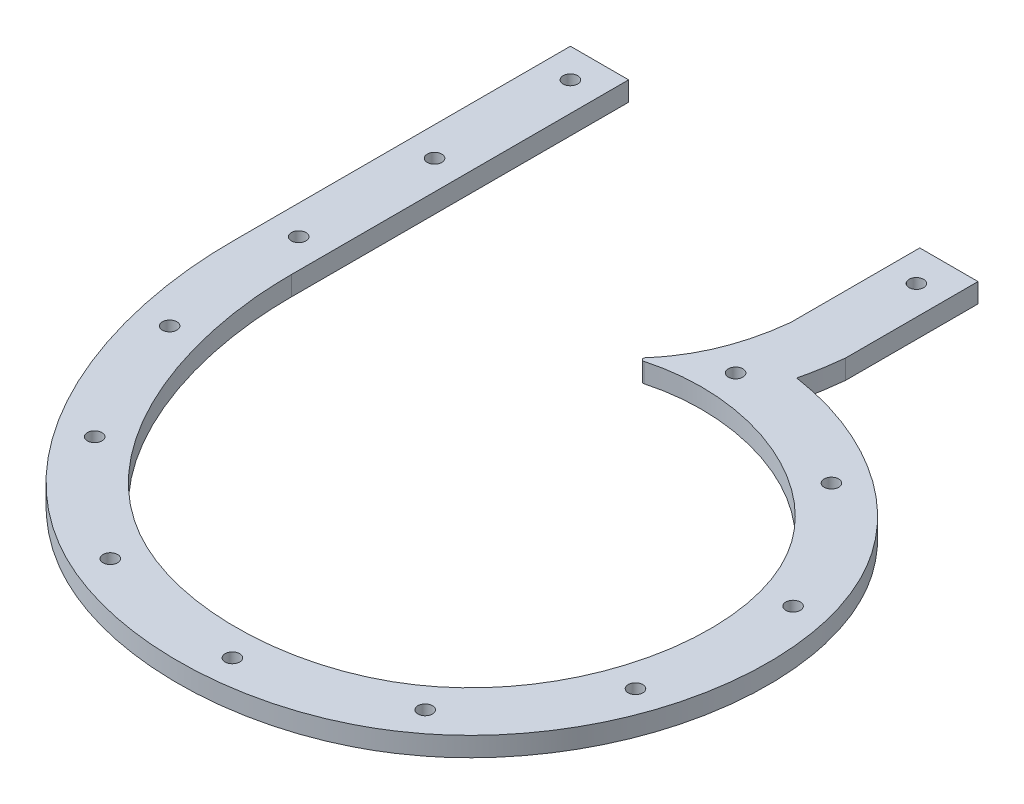
ISO-10303-21;
HEADER;
FILE_DESCRIPTION(('STEP AP214'),'2;1');
FILE_NAME('part.step','',(''),(''),'','','');
FILE_SCHEMA(('AUTOMOTIVE_DESIGN { 1 0 10303 214 1 1 1 1 }'));
ENDSEC;
DATA;
#1=APPLICATION_CONTEXT('core data for automotive mechanical design processes');
#2=APPLICATION_PROTOCOL_DEFINITION('international standard','automotive_design',2000,#1);
#3=PRODUCT_CONTEXT('',#1,'mechanical');
#4=PRODUCT('Part','Part','',(#3));
#5=PRODUCT_RELATED_PRODUCT_CATEGORY('part','',(#4));
#6=PRODUCT_DEFINITION_FORMATION('','',#4);
#7=PRODUCT_DEFINITION_CONTEXT('part definition',#1,'design');
#8=PRODUCT_DEFINITION('design','',#6,#7);
#9=PRODUCT_DEFINITION_SHAPE('','',#8);
#10=(LENGTH_UNIT() NAMED_UNIT(*) SI_UNIT(.MILLI.,.METRE.));
#11=(NAMED_UNIT(*) PLANE_ANGLE_UNIT() SI_UNIT($,.RADIAN.));
#12=(NAMED_UNIT(*) SI_UNIT($,.STERADIAN.) SOLID_ANGLE_UNIT());
#13=UNCERTAINTY_MEASURE_WITH_UNIT(LENGTH_MEASURE(1.E-05),#10,'distance_accuracy_value','');
#14=(GEOMETRIC_REPRESENTATION_CONTEXT(3) GLOBAL_UNCERTAINTY_ASSIGNED_CONTEXT((#13)) GLOBAL_UNIT_ASSIGNED_CONTEXT((#10,
#11,#12)) REPRESENTATION_CONTEXT('',''));
#15=CARTESIAN_POINT('',(0.,0.,0.));
#16=DIRECTION('',(0.,0.,1.));
#17=DIRECTION('',(1.,0.,0.));
#18=AXIS2_PLACEMENT_3D('',#15,#16,#17);
#19=CARTESIAN_POINT('',(19.05,6.35,-93.0525131214236));
#20=CARTESIAN_POINT('',(19.0235717626698,6.35,-92.8091366928728));
#21=CARTESIAN_POINT('',(18.9836928683942,6.35,-92.4430892244958));
#22=CARTESIAN_POINT('',(18.9314671624808,6.35,-91.9589572355302));
#23=CARTESIAN_POINT('',(18.8623607981838,6.35,-91.3379157509415));
#24=CARTESIAN_POINT('',(18.7762928711156,6.35,-90.6107808851603));
#25=CARTESIAN_POINT('',(18.6259027213404,6.35,-89.4251283904721));
#26=CARTESIAN_POINT('',(18.4201228683112,6.35,-87.9598584476399));
#27=CARTESIAN_POINT('',(18.0499905632596,6.35,-85.6275758075247));
#28=CARTESIAN_POINT('',(17.5101435713735,6.35,-82.7435971471794));
#29=CARTESIAN_POINT('',(16.996105498509,6.35,-80.4784646355363));
#30=CARTESIAN_POINT('',(16.7159863913014,6.35,-79.3485680085002));
#31=B_SPLINE_CURVE_WITH_KNOTS('',3,(#19,#20,#21,#22,#23,#24,#25,#26,#27,#28,#29,#30),
.UNSPECIFIED.,.F.,.F.,(4,1,1,1,1,1,1,1,1,4),(-0.0228949743215874,-0.00659054938911569,
0.00156166307712017,0.00971387554335602,0.0260183004758277,0.0423227254082994,
0.0749315752732429,0.107540425138186,0.172758124868073,0.23797582459796),.UNSPECIFIED.);
#32=DIRECTION('',(0.,-1.,0.));
#33=VECTOR('',#32,1.);
#34=SURFACE_OF_LINEAR_EXTRUSION('',#31,#33);
#35=CARTESIAN_POINT('',(19.05,0.,-93.0525131214236));
#36=CARTESIAN_POINT('',(19.0235717626698,0.,-92.8091366928728));
#37=CARTESIAN_POINT('',(18.9836928683942,0.,-92.4430892244958));
#38=CARTESIAN_POINT('',(18.9314671624808,0.,-91.9589572355302));
#39=CARTESIAN_POINT('',(18.8623607981838,0.,-91.3379157509415));
#40=CARTESIAN_POINT('',(18.7762928711156,0.,-90.6107808851603));
#41=CARTESIAN_POINT('',(18.6259027213404,0.,-89.4251283904721));
#42=CARTESIAN_POINT('',(18.4201228683112,0.,-87.9598584476399));
#43=CARTESIAN_POINT('',(18.0499905632596,0.,-85.6275758075247));
#44=CARTESIAN_POINT('',(17.5101435713735,0.,-82.7435971471794));
#45=CARTESIAN_POINT('',(16.996105498509,0.,-80.4784646355363));
#46=CARTESIAN_POINT('',(16.7159863913014,0.,-79.3485680085002));
#47=B_SPLINE_CURVE_WITH_KNOTS('',3,(#35,#36,#37,#38,#39,#40,#41,#42,#43,#44,#45,#46),
.UNSPECIFIED.,.F.,.F.,(4,1,1,1,1,1,1,1,1,4),(-0.0228949743215874,-0.00659054938911569,
0.00156166307712017,0.00971387554335602,0.0260183004758277,0.0423227254082994,
0.0749315752732429,0.107540425138186,0.172758124868073,0.23797582459796),.UNSPECIFIED.);
#48=CARTESIAN_POINT('',(19.05,0.,-93.0525131214236));
#49=VERTEX_POINT('',#48);
#50=CARTESIAN_POINT('',(16.7159863913014,0.,-79.3485680085002));
#51=VERTEX_POINT('',#50);
#52=EDGE_CURVE('E167',#49,#51,#47,.T.);
#53=ORIENTED_EDGE('',*,*,#52,.F.);
#54=DIRECTION('',(0.,-1.,0.));
#55=VECTOR('',#54,1.);
#56=CARTESIAN_POINT('',(19.05,6.35,-93.0525131214236));
#57=LINE('',#56,#55);
#58=CARTESIAN_POINT('',(19.05,6.35,-93.0525131214236));
#59=VERTEX_POINT('',#58);
#60=EDGE_CURVE('E162',#59,#49,#57,.T.);
#61=ORIENTED_EDGE('',*,*,#60,.F.);
#62=CARTESIAN_POINT('',(16.7159863913014,6.35,-79.3485680085002));
#63=VERTEX_POINT('',#62);
#64=EDGE_CURVE('E164',#59,#63,#31,.T.);
#65=ORIENTED_EDGE('',*,*,#64,.T.);
#66=DIRECTION('',(0.,-1.,0.));
#67=VECTOR('',#66,1.);
#68=CARTESIAN_POINT('',(16.7159863913014,6.35,-79.3485680085002));
#69=LINE('',#68,#67);
#70=EDGE_CURVE('E293',#63,#51,#69,.T.);
#71=ORIENTED_EDGE('',*,*,#70,.T.);
#72=EDGE_LOOP('',(#53,#61,#65,#71));
#73=FACE_BOUND('',#72,.T.);
#74=ADVANCED_FACE('F67',(#73),#34,.T.);
#75=CARTESIAN_POINT('',(19.05,6.35,0.));
#76=DIRECTION('',(1.,0.,0.));
#77=DIRECTION('',(0.,0.,-1.));
#78=AXIS2_PLACEMENT_3D('',#75,#76,#77);
#79=PLANE('',#78);
#80=DIRECTION('',(0.,0.,1.));
#81=VECTOR('',#80,1.);
#82=CARTESIAN_POINT('',(19.05,0.,0.));
#83=LINE('',#82,#81);
#84=CARTESIAN_POINT('',(19.05,0.,-136.334024978483));
#85=VERTEX_POINT('',#84);
#86=EDGE_CURVE('E660',#85,#49,#83,.T.);
#87=ORIENTED_EDGE('',*,*,#86,.F.);
#88=DIRECTION('',(0.,-1.,0.));
#89=VECTOR('',#88,1.);
#90=CARTESIAN_POINT('',(19.05,6.35,-136.334024978483));
#91=LINE('',#90,#89);
#92=CARTESIAN_POINT('',(19.05,6.35,-136.334024978483));
#93=VERTEX_POINT('',#92);
#94=EDGE_CURVE('E173',#93,#85,#91,.T.);
#95=ORIENTED_EDGE('',*,*,#94,.F.);
#96=DIRECTION('',(0.,0.,1.));
#97=VECTOR('',#96,1.);
#98=CARTESIAN_POINT('',(19.05,6.35,0.));
#99=LINE('',#98,#97);
#100=EDGE_CURVE('E178',#93,#59,#99,.T.);
#101=ORIENTED_EDGE('',*,*,#100,.T.);
#102=ORIENTED_EDGE('',*,*,#60,.T.);
#103=EDGE_LOOP('',(#87,#95,#101,#102));
#104=FACE_BOUND('',#103,.T.);
#105=ADVANCED_FACE('F183',(#104),#79,.T.);
#106=CARTESIAN_POINT('',(0.,6.35,-136.334024978483));
#107=DIRECTION('',(0.,0.,1.));
#108=DIRECTION('',(1.,0.,0.));
#109=AXIS2_PLACEMENT_3D('',#106,#107,#108);
#110=PLANE('',#109);
#111=DIRECTION('',(-1.,0.,0.));
#112=VECTOR('',#111,1.);
#113=CARTESIAN_POINT('',(0.,0.,-136.334024978483));
#114=LINE('',#113,#112);
#115=CARTESIAN_POINT('',(0.,0.,-136.334024978483));
#116=VERTEX_POINT('',#115);
#117=EDGE_CURVE('E662',#85,#116,#114,.T.);
#118=ORIENTED_EDGE('',*,*,#117,.T.);
#119=DIRECTION('',(0.,-1.,0.));
#120=VECTOR('',#119,1.);
#121=CARTESIAN_POINT('',(0.,6.35,-136.334024978483));
#122=LINE('',#121,#120);
#123=CARTESIAN_POINT('',(0.,6.35,-136.334024978483));
#124=VERTEX_POINT('',#123);
#125=EDGE_CURVE('E305',#124,#116,#122,.T.);
#126=ORIENTED_EDGE('',*,*,#125,.F.);
#127=DIRECTION('',(-1.,0.,0.));
#128=VECTOR('',#127,1.);
#129=CARTESIAN_POINT('',(0.,6.35,-136.334024978483));
#130=LINE('',#129,#128);
#131=EDGE_CURVE('E185',#93,#124,#130,.T.);
#132=ORIENTED_EDGE('',*,*,#131,.F.);
#133=ORIENTED_EDGE('',*,*,#94,.T.);
#134=EDGE_LOOP('',(#118,#126,#132,#133));
#135=FACE_BOUND('',#134,.T.);
#136=ADVANCED_FACE('F219',(#135),#110,.F.);
#137=CARTESIAN_POINT('',(0.,6.35,0.));
#138=DIRECTION('',(1.,0.,0.));
#139=DIRECTION('',(0.,0.,-1.));
#140=AXIS2_PLACEMENT_3D('',#137,#138,#139);
#141=PLANE('',#140);
#142=DIRECTION('',(0.,0.,1.));
#143=VECTOR('',#142,1.);
#144=CARTESIAN_POINT('',(0.,0.,0.));
#145=LINE('',#144,#143);
#146=CARTESIAN_POINT('',(0.,0.,-94.2223410161257));
#147=VERTEX_POINT('',#146);
#148=EDGE_CURVE('E274',#116,#147,#145,.T.);
#149=ORIENTED_EDGE('',*,*,#148,.T.);
#150=DIRECTION('',(0.,1.,0.));
#151=VECTOR('',#150,1.);
#152=CARTESIAN_POINT('',(0.,6.35,-94.2223410161257));
#153=LINE('',#152,#151);
#154=CARTESIAN_POINT('',(0.,6.35,-94.2223410161257));
#155=VERTEX_POINT('',#154);
#156=EDGE_CURVE('E311',#147,#155,#153,.T.);
#157=ORIENTED_EDGE('',*,*,#156,.T.);
#158=DIRECTION('',(0.,0.,1.));
#159=VECTOR('',#158,1.);
#160=CARTESIAN_POINT('',(0.,6.35,0.));
#161=LINE('',#160,#159);
#162=EDGE_CURVE('E187',#124,#155,#161,.T.);
#163=ORIENTED_EDGE('',*,*,#162,.F.);
#164=ORIENTED_EDGE('',*,*,#125,.T.);
#165=EDGE_LOOP('',(#149,#157,#163,#164));
#166=FACE_BOUND('',#165,.T.);
#167=ADVANCED_FACE('F215',(#166),#141,.F.);
#168=CARTESIAN_POINT('',(0.,6.35,-94.0838012465403));
#169=CARTESIAN_POINT('',(-2.43138633589178,6.35,-71.6932757089573));
#170=CARTESIAN_POINT('',(-15.7582559300183,6.35,-58.2304301464796));
#171=B_SPLINE_CURVE_WITH_KNOTS('',2,(#168,#169,#170),.UNSPECIFIED.,.F.,.F.,(3,3),(0.,1.),.UNSPECIFIED.);
#172=DIRECTION('',(0.,-1.,0.));
#173=VECTOR('',#172,1.);
#174=SURFACE_OF_LINEAR_EXTRUSION('',#171,#173);
#175=CARTESIAN_POINT('',(0.,0.,-94.0838012465403));
#176=CARTESIAN_POINT('',(-2.43138633589178,0.,-71.6932757089573));
#177=CARTESIAN_POINT('',(-15.7582559300183,0.,-58.2304301464796));
#178=B_SPLINE_CURVE_WITH_KNOTS('',2,(#175,#176,#177),.UNSPECIFIED.,.F.,.F.,(3,3),(0.,1.),.UNSPECIFIED.);
#179=CARTESIAN_POINT('',(-0.0152968925248014,0.,-93.9439991056898));
#180=VERTEX_POINT('',#179);
#181=CARTESIAN_POINT('',(-13.755858664629,0.,-60.373257901927));
#182=VERTEX_POINT('',#181);
#183=EDGE_CURVE('E270',#180,#182,#178,.T.);
#184=ORIENTED_EDGE('',*,*,#183,.T.);
#185=DIRECTION('',(0.,-1.,0.));
#186=VECTOR('',#185,1.);
#187=CARTESIAN_POINT('',(-13.755858664629,0.,-60.373257901927));
#188=LINE('',#187,#186);
#189=CARTESIAN_POINT('',(-13.755858664629,6.35,-60.373257901927));
#190=VERTEX_POINT('',#189);
#191=EDGE_CURVE('E75',#182,#190,#188,.F.);
#192=ORIENTED_EDGE('',*,*,#191,.T.);
#193=CARTESIAN_POINT('',(-0.0152968925248014,6.35,-93.9439991056898));
#194=VERTEX_POINT('',#193);
#195=EDGE_CURVE('E196',#194,#190,#171,.T.);
#196=ORIENTED_EDGE('',*,*,#195,.F.);
#197=DIRECTION('',(0.,-1.,0.));
#198=VECTOR('',#197,1.);
#199=CARTESIAN_POINT('',(-0.0152968925248033,6.35,-93.9439991056898));
#200=LINE('',#199,#198);
#201=EDGE_CURVE('E172',#194,#180,#200,.T.);
#202=ORIENTED_EDGE('',*,*,#201,.T.);
#203=EDGE_LOOP('',(#184,#192,#196,#202));
#204=FACE_BOUND('',#203,.T.);
#205=ADVANCED_FACE('F210',(#204),#174,.F.);
#206=CARTESIAN_POINT('',(-15.7582559300183,6.35,-58.2304301464796));
#207=CARTESIAN_POINT('',(12.9289974081269,6.35,-67.7641355953099));
#208=CARTESIAN_POINT('',(70.6012230100739,6.35,-46.2471030474948));
#209=CARTESIAN_POINT('',(77.5403837984392,6.35,26.2134938435259));
#210=CARTESIAN_POINT('',(40.5187887248898,6.35,85.7752611581171));
#211=CARTESIAN_POINT('',(-67.0551085723347,6.35,88.3042799218699));
#212=CARTESIAN_POINT('',(-95.4157076808293,6.35,10.2144859273095));
#213=CARTESIAN_POINT('',(-95.25,6.35,-26.0301706486655));
#214=B_SPLINE_CURVE_WITH_KNOTS('',3,(#206,#207,#208,#209,#210,#211,#212,#213),.UNSPECIFIED.,.F.,
.F.,(4,1,1,1,1,4),(0.,0.227546357084691,0.356849792544047,0.495812359937748,0.710996888369488,
1.),.UNSPECIFIED.);
#215=DIRECTION('',(0.,-1.,0.));
#216=VECTOR('',#215,1.);
#217=SURFACE_OF_LINEAR_EXTRUSION('',#214,#216);
#218=CARTESIAN_POINT('',(-12.9496367933821,6.35,-59.0830694012671));
#219=VERTEX_POINT('',#218);
#220=CARTESIAN_POINT('',(-95.2500259941821,6.35,-26.0244551898569));
#221=VERTEX_POINT('',#220);
#222=EDGE_CURVE('E201',#219,#221,#214,.T.);
#223=ORIENTED_EDGE('',*,*,#222,.F.);
#224=DIRECTION('',(0.,-1.,0.));
#225=VECTOR('',#224,1.);
#226=CARTESIAN_POINT('',(-12.9496367933821,6.35,-59.0830694012671));
#227=LINE('',#226,#225);
#228=CARTESIAN_POINT('',(-12.9496367933821,0.,-59.0830694012671));
#229=VERTEX_POINT('',#228);
#230=EDGE_CURVE('E259',#219,#229,#227,.T.);
#231=ORIENTED_EDGE('',*,*,#230,.T.);
#232=CARTESIAN_POINT('',(-15.7582559300183,0.,-58.2304301464796));
#233=CARTESIAN_POINT('',(12.9289974081269,0.,-67.7641355953099));
#234=CARTESIAN_POINT('',(70.6012230100739,0.,-46.2471030474948));
#235=CARTESIAN_POINT('',(77.5403837984392,0.,26.2134938435259));
#236=CARTESIAN_POINT('',(40.5187887248898,0.,85.7752611581171));
#237=CARTESIAN_POINT('',(-67.0551085723347,0.,88.3042799218699));
#238=CARTESIAN_POINT('',(-95.4157076808293,0.,10.2144859273095));
#239=CARTESIAN_POINT('',(-95.25,0.,-26.0301706486655));
#240=B_SPLINE_CURVE_WITH_KNOTS('',3,(#232,#233,#234,#235,#236,#237,#238,#239),.UNSPECIFIED.,.F.,
.F.,(4,1,1,1,1,4),(0.,0.227546357084691,0.356849792544047,0.495812359937748,0.710996888369488,
1.),.UNSPECIFIED.);
#241=CARTESIAN_POINT('',(-95.2500259941821,0.,-26.0244551898569));
#242=VERTEX_POINT('',#241);
#243=EDGE_CURVE('E265',#229,#242,#240,.T.);
#244=ORIENTED_EDGE('',*,*,#243,.T.);
#245=DIRECTION('',(0.,-1.,0.));
#246=VECTOR('',#245,1.);
#247=CARTESIAN_POINT('',(-95.2500259941821,0.,-26.0244551898569));
#248=LINE('',#247,#246);
#249=EDGE_CURVE('E245',#242,#221,#248,.F.);
#250=ORIENTED_EDGE('',*,*,#249,.T.);
#251=EDGE_LOOP('',(#223,#231,#244,#250));
#252=FACE_BOUND('',#251,.T.);
#253=ADVANCED_FACE('F214',(#252),#217,.F.);
#254=CARTESIAN_POINT('',(-95.25,6.35,0.));
#255=DIRECTION('',(1.,0.,0.));
#256=DIRECTION('',(0.,0.,-1.));
#257=AXIS2_PLACEMENT_3D('',#254,#255,#256);
#258=PLANE('',#257);
#259=DIRECTION('',(0.,0.,1.));
#260=VECTOR('',#259,1.);
#261=CARTESIAN_POINT('',(-95.25,6.35,0.));
#262=LINE('',#261,#260);
#263=CARTESIAN_POINT('',(-95.25,6.35,-136.334024978483));
#264=VERTEX_POINT('',#263);
#265=CARTESIAN_POINT('',(-95.25,6.35,-26.0359464808754));
#266=VERTEX_POINT('',#265);
#267=EDGE_CURVE('E316',#264,#266,#262,.T.);
#268=ORIENTED_EDGE('',*,*,#267,.T.);
#269=DIRECTION('',(0.,1.,0.));
#270=VECTOR('',#269,1.);
#271=CARTESIAN_POINT('',(-95.25,0.,-26.0359464808754));
#272=LINE('',#271,#270);
#273=CARTESIAN_POINT('',(-95.25,0.,-26.0359464808754));
#274=VERTEX_POINT('',#273);
#275=EDGE_CURVE('E247',#266,#274,#272,.F.);
#276=ORIENTED_EDGE('',*,*,#275,.T.);
#277=DIRECTION('',(0.,0.,1.));
#278=VECTOR('',#277,1.);
#279=CARTESIAN_POINT('',(-95.25,0.,0.));
#280=LINE('',#279,#278);
#281=CARTESIAN_POINT('',(-95.25,0.,-136.334024978483));
#282=VERTEX_POINT('',#281);
#283=EDGE_CURVE('E269',#282,#274,#280,.T.);
#284=ORIENTED_EDGE('',*,*,#283,.F.);
#285=DIRECTION('',(0.,-1.,0.));
#286=VECTOR('',#285,1.);
#287=CARTESIAN_POINT('',(-95.25,6.35,-136.334024978483));
#288=LINE('',#287,#286);
#289=EDGE_CURVE('E303',#264,#282,#288,.T.);
#290=ORIENTED_EDGE('',*,*,#289,.F.);
#291=EDGE_LOOP('',(#268,#276,#284,#290));
#292=FACE_BOUND('',#291,.T.);
#293=ADVANCED_FACE('F315',(#292),#258,.T.);
#294=CARTESIAN_POINT('',(0.,6.35,-136.334024978483));
#295=DIRECTION('',(0.,0.,1.));
#296=DIRECTION('',(1.,0.,0.));
#297=AXIS2_PLACEMENT_3D('',#294,#295,#296);
#298=PLANE('',#297);
#299=DIRECTION('',(-1.,0.,0.));
#300=VECTOR('',#299,1.);
#301=CARTESIAN_POINT('',(0.,0.,-136.334024978483));
#302=LINE('',#301,#300);
#303=CARTESIAN_POINT('',(-114.3,0.,-136.334024978483));
#304=VERTEX_POINT('',#303);
#305=EDGE_CURVE('E272',#282,#304,#302,.T.);
#306=ORIENTED_EDGE('',*,*,#305,.T.);
#307=DIRECTION('',(0.,-1.,0.));
#308=VECTOR('',#307,1.);
#309=CARTESIAN_POINT('',(-114.3,6.35,-136.334024978483));
#310=LINE('',#309,#308);
#311=CARTESIAN_POINT('',(-114.3,6.35,-136.334024978483));
#312=VERTEX_POINT('',#311);
#313=EDGE_CURVE('E300',#312,#304,#310,.T.);
#314=ORIENTED_EDGE('',*,*,#313,.F.);
#315=DIRECTION('',(-1.,0.,0.));
#316=VECTOR('',#315,1.);
#317=CARTESIAN_POINT('',(0.,6.35,-136.334024978483));
#318=LINE('',#317,#316);
#319=EDGE_CURVE('E328',#264,#312,#318,.T.);
#320=ORIENTED_EDGE('',*,*,#319,.F.);
#321=ORIENTED_EDGE('',*,*,#289,.T.);
#322=EDGE_LOOP('',(#306,#314,#320,#321));
#323=FACE_BOUND('',#322,.T.);
#324=ADVANCED_FACE('F321',(#323),#298,.F.);
#325=CARTESIAN_POINT('',(-114.3,6.35,0.));
#326=DIRECTION('',(1.,0.,0.));
#327=DIRECTION('',(0.,0.,-1.));
#328=AXIS2_PLACEMENT_3D('',#325,#326,#327);
#329=PLANE('',#328);
#330=DIRECTION('',(0.,0.,1.));
#331=VECTOR('',#330,1.);
#332=CARTESIAN_POINT('',(-114.3,0.,0.));
#333=LINE('',#332,#331);
#334=CARTESIAN_POINT('',(-114.3,0.,-26.0721112281661));
#335=VERTEX_POINT('',#334);
#336=EDGE_CURVE('E286',#304,#335,#333,.T.);
#337=ORIENTED_EDGE('',*,*,#336,.T.);
#338=DIRECTION('',(0.,-1.,0.));
#339=VECTOR('',#338,1.);
#340=CARTESIAN_POINT('',(-114.3,6.35,-26.0721112281661));
#341=LINE('',#340,#339);
#342=CARTESIAN_POINT('',(-114.3,6.35,-26.0721112281661));
#343=VERTEX_POINT('',#342);
#344=EDGE_CURVE('E298',#343,#335,#341,.T.);
#345=ORIENTED_EDGE('',*,*,#344,.F.);
#346=DIRECTION('',(0.,0.,1.));
#347=VECTOR('',#346,1.);
#348=CARTESIAN_POINT('',(-114.3,6.35,0.));
#349=LINE('',#348,#347);
#350=EDGE_CURVE('E327',#312,#343,#349,.T.);
#351=ORIENTED_EDGE('',*,*,#350,.F.);
#352=ORIENTED_EDGE('',*,*,#313,.T.);
#353=EDGE_LOOP('',(#337,#345,#351,#352));
#354=FACE_BOUND('',#353,.T.);
#355=ADVANCED_FACE('F325',(#354),#329,.F.);
#356=CARTESIAN_POINT('',(16.7159863913014,6.35,-79.3485680085002));
#357=CARTESIAN_POINT('',(21.6330978705224,6.35,-78.6271989598531));
#358=CARTESIAN_POINT('',(31.3718572612699,6.35,-76.3897218941116));
#359=CARTESIAN_POINT('',(45.2492004972199,6.35,-70.8452769607163));
#360=CARTESIAN_POINT('',(58.1427020202069,6.35,-63.2023547019803));
#361=CARTESIAN_POINT('',(69.6942684990019,6.35,-53.48659400402));
#362=CARTESIAN_POINT('',(77.8316458808527,6.35,-43.6787438983676));
#363=CARTESIAN_POINT('',(83.1663553001762,6.35,-34.7783260421134));
#364=CARTESIAN_POINT('',(87.5006566564551,6.35,-25.5003387116442));
#365=CARTESIAN_POINT('',(91.1570644324476,6.35,-13.4000448880706));
#366=CARTESIAN_POINT('',(92.9989240789807,6.35,1.46366621805663));
#367=CARTESIAN_POINT('',(92.5331586276137,6.35,16.3321608555447));
#368=CARTESIAN_POINT('',(89.9113480457351,6.35,30.9228680078494));
#369=CARTESIAN_POINT('',(85.2246697026399,6.35,44.926534482478));
#370=CARTESIAN_POINT('',(78.5424766002794,6.35,58.0873215625547));
#371=CARTESIAN_POINT('',(69.8929665542091,6.35,70.1280882226925));
#372=CARTESIAN_POINT('',(59.3342250850972,6.35,80.7225189459671));
#373=CARTESIAN_POINT('',(46.8082946762808,6.35,89.4843789599546));
#374=CARTESIAN_POINT('',(33.1657508535722,6.35,95.8312045365591));
#375=CARTESIAN_POINT('',(18.8220757998214,6.35,100.000437450495));
#376=CARTESIAN_POINT('',(4.08382286145167,6.35,102.10160242432));
#377=CARTESIAN_POINT('',(-10.7774412230892,6.35,102.21979996101));
#378=CARTESIAN_POINT('',(-25.5048511364746,6.35,100.381408636179));
#379=CARTESIAN_POINT('',(-37.4527415030442,6.35,97.1973224935949));
#380=CARTESIAN_POINT('',(-46.6656390896169,6.35,93.6226539944936));
#381=CARTESIAN_POINT('',(-53.3782339827533,6.35,90.4042691275464));
#382=CARTESIAN_POINT('',(-59.7780191628772,6.35,86.6678318366041));
#383=CARTESIAN_POINT('',(-67.7729642470086,6.35,81.1134949695859));
#384=CARTESIAN_POINT('',(-76.7948383172267,6.35,73.1919966973664));
#385=CARTESIAN_POINT('',(-86.0825071986507,6.35,62.4802459776523));
#386=CARTESIAN_POINT('',(-96.5268651878926,6.35,46.9789350867326));
#387=CARTESIAN_POINT('',(-104.247410810002,6.35,30.1516401250863));
#388=CARTESIAN_POINT('',(-109.533831829891,6.35,12.8006946264713));
#389=CARTESIAN_POINT('',(-112.324631517154,6.35,-0.30605110665803));
#390=CARTESIAN_POINT('',(-113.69827349308,6.35,-11.1587802232802));
#391=CARTESIAN_POINT('',(-114.231429958165,6.35,-19.7408930873515));
#392=CARTESIAN_POINT('',(-114.308990647516,6.35,-23.9549561001606));
#393=CARTESIAN_POINT('',(-114.3,6.35,-26.0721112281661));
#394=B_SPLINE_CURVE_WITH_KNOTS('',3,(#356,#357,#358,#359,#360,#361,#362,#363,#364,#365,#366,
#367,#368,#369,#370,#371,#372,#373,#374,#375,#376,#377,#378,#379,#380,#381,#382,#383,#384,#385,
#386,#387,#388,#389,#390,#391,#392,#393),.UNSPECIFIED.,.F.,.F.,(4,1,1,1,1,1,1,1,1,1,1,1,1,1,1,1,
1,1,1,1,1,1,1,1,1,1,1,1,1,1,1,1,1,1,1,4),(0.0744180317666386,0.103339232907731,
0.132260434048823,0.161181635189916,0.190102836331008,0.2190240374721,0.233484638042646,
0.247945238613193,0.276866439754285,0.305787640895377,0.33470884203647,0.363630043177562,
0.392551244318654,0.421472445459747,0.450393646600839,0.479314847741931,0.508236048883024,
0.537157250024116,0.566078451165208,0.594999652306301,0.623920853447393,0.652842054588485,
0.681763255729578,0.696223856300124,0.71068445687067,0.725145057441216,0.739605658011762,
0.768526859152855,0.797448060293947,0.826369261435039,0.884211663717224,0.913132864858316,
0.942054065999409,0.970975267140501,0.985435867711047,0.999896468281593),.UNSPECIFIED.);
#395=DIRECTION('',(0.,-1.,0.));
#396=VECTOR('',#395,1.);
#397=SURFACE_OF_LINEAR_EXTRUSION('',#394,#396);
#398=CARTESIAN_POINT('',(16.7159863913014,0.,-79.3485680085002));
#399=CARTESIAN_POINT('',(21.6330978705224,0.,-78.6271989598531));
#400=CARTESIAN_POINT('',(31.3718572612699,0.,-76.3897218941116));
#401=CARTESIAN_POINT('',(45.2492004972199,0.,-70.8452769607163));
#402=CARTESIAN_POINT('',(58.1427020202069,0.,-63.2023547019803));
#403=CARTESIAN_POINT('',(69.6942684990019,0.,-53.48659400402));
#404=CARTESIAN_POINT('',(77.8316458808527,0.,-43.6787438983676));
#405=CARTESIAN_POINT('',(83.1663553001762,0.,-34.7783260421134));
#406=CARTESIAN_POINT('',(87.5006566564551,0.,-25.5003387116442));
#407=CARTESIAN_POINT('',(91.1570644324476,0.,-13.4000448880706));
#408=CARTESIAN_POINT('',(92.9989240789807,0.,1.46366621805663));
#409=CARTESIAN_POINT('',(92.5331586276137,0.,16.3321608555447));
#410=CARTESIAN_POINT('',(89.9113480457351,0.,30.9228680078494));
#411=CARTESIAN_POINT('',(85.2246697026399,0.,44.926534482478));
#412=CARTESIAN_POINT('',(78.5424766002794,0.,58.0873215625547));
#413=CARTESIAN_POINT('',(69.8929665542091,0.,70.1280882226925));
#414=CARTESIAN_POINT('',(59.3342250850972,0.,80.7225189459671));
#415=CARTESIAN_POINT('',(46.8082946762808,0.,89.4843789599546));
#416=CARTESIAN_POINT('',(33.1657508535722,0.,95.8312045365591));
#417=CARTESIAN_POINT('',(18.8220757998214,0.,100.000437450495));
#418=CARTESIAN_POINT('',(4.08382286145167,0.,102.10160242432));
#419=CARTESIAN_POINT('',(-10.7774412230892,0.,102.21979996101));
#420=CARTESIAN_POINT('',(-25.5048511364746,0.,100.381408636179));
#421=CARTESIAN_POINT('',(-37.4527415030442,0.,97.1973224935949));
#422=CARTESIAN_POINT('',(-46.6656390896169,0.,93.6226539944936));
#423=CARTESIAN_POINT('',(-53.3782339827533,0.,90.4042691275464));
#424=CARTESIAN_POINT('',(-59.7780191628772,0.,86.6678318366041));
#425=CARTESIAN_POINT('',(-67.7729642470086,0.,81.1134949695859));
#426=CARTESIAN_POINT('',(-76.7948383172267,0.,73.1919966973664));
#427=CARTESIAN_POINT('',(-86.0825071986507,0.,62.4802459776523));
#428=CARTESIAN_POINT('',(-96.5268651878926,0.,46.9789350867326));
#429=CARTESIAN_POINT('',(-104.247410810002,0.,30.1516401250863));
#430=CARTESIAN_POINT('',(-109.533831829891,0.,12.8006946264713));
#431=CARTESIAN_POINT('',(-112.324631517154,0.,-0.30605110665803));
#432=CARTESIAN_POINT('',(-113.69827349308,0.,-11.1587802232802));
#433=CARTESIAN_POINT('',(-114.231429958165,0.,-19.7408930873515));
#434=CARTESIAN_POINT('',(-114.308990647516,0.,-23.9549561001606));
#435=CARTESIAN_POINT('',(-114.3,0.,-26.0721112281661));
#436=B_SPLINE_CURVE_WITH_KNOTS('',3,(#398,#399,#400,#401,#402,#403,#404,#405,#406,#407,#408,
#409,#410,#411,#412,#413,#414,#415,#416,#417,#418,#419,#420,#421,#422,#423,#424,#425,#426,#427,
#428,#429,#430,#431,#432,#433,#434,#435),.UNSPECIFIED.,.F.,.F.,(4,1,1,1,1,1,1,1,1,1,1,1,1,1,1,1,
1,1,1,1,1,1,1,1,1,1,1,1,1,1,1,1,1,1,1,4),(0.0744180317666386,0.103339232907731,
0.132260434048823,0.161181635189916,0.190102836331008,0.2190240374721,0.233484638042646,
0.247945238613193,0.276866439754285,0.305787640895377,0.33470884203647,0.363630043177562,
0.392551244318654,0.421472445459747,0.450393646600839,0.479314847741931,0.508236048883024,
0.537157250024116,0.566078451165208,0.594999652306301,0.623920853447393,0.652842054588485,
0.681763255729578,0.696223856300124,0.71068445687067,0.725145057441216,0.739605658011762,
0.768526859152855,0.797448060293947,0.826369261435039,0.884211663717224,0.913132864858316,
0.942054065999409,0.970975267140501,0.985435867711047,0.999896468281593),.UNSPECIFIED.);
#437=EDGE_CURVE('E181',#51,#335,#436,.T.);
#438=ORIENTED_EDGE('',*,*,#437,.F.);
#439=ORIENTED_EDGE('',*,*,#70,.F.);
#440=EDGE_CURVE('E180',#63,#343,#394,.T.);
#441=ORIENTED_EDGE('',*,*,#440,.T.);
#442=ORIENTED_EDGE('',*,*,#344,.T.);
#443=EDGE_LOOP('',(#438,#439,#441,#442));
#444=FACE_BOUND('',#443,.T.);
#445=ADVANCED_FACE('F343',(#444),#397,.T.);
#446=CARTESIAN_POINT('',(0.,6.35,0.));
#447=DIRECTION('',(0.,1.,0.));
#448=DIRECTION('',(0.,0.,1.));
#449=AXIS2_PLACEMENT_3D('',#446,#447,#448);
#450=PLANE('',#449);
#451=CARTESIAN_POINT('',(9.52499999999998,6.34999999986404,-125.703541590997));
#452=DIRECTION('',(0.,1.,0.));
#453=DIRECTION('',(0.,0.,1.));
#454=AXIS2_PLACEMENT_3D('',#451,#452,#453);
#455=CIRCLE('',#454,2.38125);
#456=CARTESIAN_POINT('',(9.52499999999998,6.34999999986404,-123.322291590997));
#457=VERTEX_POINT('',#456);
#458=EDGE_CURVE('E581',#457,#457,#455,.T.);
#459=ORIENTED_EDGE('',*,*,#458,.F.);
#460=EDGE_LOOP('',(#459));
#461=FACE_BOUND('',#460,.T.);
#462=CARTESIAN_POINT('',(5.30214698446013,6.34999999987513,-70.7696736998972));
#463=DIRECTION('',(0.,1.,0.));
#464=DIRECTION('',(0.,0.,1.));
#465=AXIS2_PLACEMENT_3D('',#462,#463,#464);
#466=CIRCLE('',#465,2.38125);
#467=CARTESIAN_POINT('',(5.30214698446013,6.34999999987513,-68.3884236998972));
#468=VERTEX_POINT('',#467);
#469=EDGE_CURVE('E583',#468,#468,#466,.T.);
#470=ORIENTED_EDGE('',*,*,#469,.F.);
#471=EDGE_LOOP('',(#470));
#472=FACE_BOUND('',#471,.T.);
#473=CARTESIAN_POINT('',(52.1827380609273,6.34999999986884,-55.2474860426569));
#474=DIRECTION('',(0.,1.,0.));
#475=DIRECTION('',(0.,0.,1.));
#476=AXIS2_PLACEMENT_3D('',#473,#474,#475);
#477=CIRCLE('',#476,2.38125);
#478=CARTESIAN_POINT('',(52.1827380609273,6.34999999986884,-52.8662360426569));
#479=VERTEX_POINT('',#478);
#480=EDGE_CURVE('E589',#479,#479,#477,.T.);
#481=ORIENTED_EDGE('',*,*,#480,.F.);
#482=EDGE_LOOP('',(#481));
#483=FACE_BOUND('',#482,.T.);
#484=CARTESIAN_POINT('',(80.7824142416887,6.34999999986437,-14.1065356394769));
#485=DIRECTION('',(0.,1.,0.));
#486=DIRECTION('',(0.,0.,1.));
#487=AXIS2_PLACEMENT_3D('',#484,#485,#486);
#488=CIRCLE('',#487,2.38125);
#489=CARTESIAN_POINT('',(80.7824142416887,6.34999999986437,-11.7252856394769));
#490=VERTEX_POINT('',#489);
#491=EDGE_CURVE('E595',#490,#490,#488,.T.);
#492=ORIENTED_EDGE('',*,*,#491,.F.);
#493=EDGE_LOOP('',(#492));
#494=FACE_BOUND('',#493,.T.);
#495=CARTESIAN_POINT('',(78.3880407363537,6.34999999986463,35.05863295914));
#496=DIRECTION('',(0.,1.,0.));
#497=DIRECTION('',(0.,0.,1.));
#498=AXIS2_PLACEMENT_3D('',#495,#496,#497);
#499=CIRCLE('',#498,2.38125);
#500=CARTESIAN_POINT('',(78.3880407363537,6.34999999986463,37.43988295914));
#501=VERTEX_POINT('',#500);
#502=EDGE_CURVE('E601',#501,#501,#499,.T.);
#503=ORIENTED_EDGE('',*,*,#502,.F.);
#504=EDGE_LOOP('',(#503));
#505=FACE_BOUND('',#504,.T.);
#506=CARTESIAN_POINT('',(49.9706498896961,6.34999999986851,75.4506365341561));
#507=DIRECTION('',(0.,1.,0.));
#508=DIRECTION('',(0.,0.,1.));
#509=AXIS2_PLACEMENT_3D('',#506,#507,#508);
#510=CIRCLE('',#509,2.38125);
#511=CARTESIAN_POINT('',(49.9706498896961,6.34999999986851,77.8318865341562));
#512=VERTEX_POINT('',#511);
#513=EDGE_CURVE('E607',#512,#512,#510,.T.);
#514=ORIENTED_EDGE('',*,*,#513,.F.);
#515=EDGE_LOOP('',(#514));
#516=FACE_BOUND('',#515,.T.);
#517=CARTESIAN_POINT('',(3.69898710459614,6.34999999987448,92.2460743206198));
#518=DIRECTION('',(0.,1.,0.));
#519=DIRECTION('',(0.,0.,1.));
#520=AXIS2_PLACEMENT_3D('',#517,#518,#519);
#521=CIRCLE('',#520,2.38125);
#522=CARTESIAN_POINT('',(3.69898710459614,6.34999999987448,94.6273243206198));
#523=VERTEX_POINT('',#522);
#524=EDGE_CURVE('E613',#523,#523,#521,.T.);
#525=ORIENTED_EDGE('',*,*,#524,.F.);
#526=EDGE_LOOP('',(#525));
#527=FACE_BOUND('',#526,.T.);
#528=CARTESIAN_POINT('',(-44.376132313222,6.34999999988007,84.1129830272196));
#529=DIRECTION('',(0.,1.,0.));
#530=DIRECTION('',(0.,0.,1.));
#531=AXIS2_PLACEMENT_3D('',#528,#529,#530);
#532=CIRCLE('',#531,2.38125);
#533=CARTESIAN_POINT('',(-44.376132313222,6.34999999988007,86.4942330272196));
#534=VERTEX_POINT('',#533);
#535=EDGE_CURVE('E619',#534,#534,#532,.T.);
#536=ORIENTED_EDGE('',*,*,#535,.F.);
#537=EDGE_LOOP('',(#536));
#538=FACE_BOUND('',#537,.T.);
#539=CARTESIAN_POINT('',(-81.4745539995221,6.34999999988469,52.1414717650409));
#540=DIRECTION('',(0.,1.,0.));
#541=DIRECTION('',(0.,0.,1.));
#542=AXIS2_PLACEMENT_3D('',#539,#540,#541);
#543=CIRCLE('',#542,2.38125);
#544=CARTESIAN_POINT('',(-81.4745539995221,6.34999999988469,54.5227217650409));
#545=VERTEX_POINT('',#544);
#546=EDGE_CURVE('E625',#545,#545,#543,.T.);
#547=ORIENTED_EDGE('',*,*,#546,.F.);
#548=EDGE_LOOP('',(#547));
#549=FACE_BOUND('',#548,.T.);
#550=CARTESIAN_POINT('',(-100.597903534507,6.34999999988637,8.4863561783266));
#551=DIRECTION('',(0.,1.,0.));
#552=DIRECTION('',(0.,0.,1.));
#553=AXIS2_PLACEMENT_3D('',#550,#551,#552);
#554=CIRCLE('',#553,2.38125);
#555=CARTESIAN_POINT('',(-100.597903534507,6.34999999988637,10.8676061783266));
#556=VERTEX_POINT('',#555);
#557=EDGE_CURVE('E631',#556,#556,#554,.T.);
#558=ORIENTED_EDGE('',*,*,#557,.F.);
#559=EDGE_LOOP('',(#558));
#560=FACE_BOUND('',#559,.T.);
#561=CARTESIAN_POINT('',(-104.775,6.3499999998867,-37.9090249784825));
#562=DIRECTION('',(0.,1.,0.));
#563=DIRECTION('',(0.,0.,1.));
#564=AXIS2_PLACEMENT_3D('',#561,#562,#563);
#565=CIRCLE('',#564,2.38125);
#566=CARTESIAN_POINT('',(-104.775,6.3499999998867,-35.5277749784825));
#567=VERTEX_POINT('',#566);
#568=EDGE_CURVE('E637',#567,#567,#565,.T.);
#569=ORIENTED_EDGE('',*,*,#568,.F.);
#570=EDGE_LOOP('',(#569));
#571=FACE_BOUND('',#570,.T.);
#572=CARTESIAN_POINT('',(-104.775,6.3499999998867,-82.3590249784825));
#573=DIRECTION('',(0.,1.,0.));
#574=DIRECTION('',(0.,0.,1.));
#575=AXIS2_PLACEMENT_3D('',#572,#573,#574);
#576=CIRCLE('',#575,2.38125);
#577=CARTESIAN_POINT('',(-104.775,6.3499999998867,-79.9777749784825));
#578=VERTEX_POINT('',#577);
#579=EDGE_CURVE('E643',#578,#578,#576,.T.);
#580=ORIENTED_EDGE('',*,*,#579,.F.);
#581=EDGE_LOOP('',(#580));
#582=FACE_BOUND('',#581,.T.);
#583=CARTESIAN_POINT('',(-104.775,6.35,-126.809024978483));
#584=DIRECTION('',(0.,1.,0.));
#585=DIRECTION('',(0.,0.,1.));
#586=AXIS2_PLACEMENT_3D('',#583,#584,#585);
#587=CIRCLE('',#586,2.38125);
#588=CARTESIAN_POINT('',(-104.775,6.35,-124.427774978483));
#589=VERTEX_POINT('',#588);
#590=EDGE_CURVE('E649',#589,#589,#587,.T.);
#591=ORIENTED_EDGE('',*,*,#590,.F.);
#592=EDGE_LOOP('',(#591));
#593=FACE_BOUND('',#592,.T.);
#594=ORIENTED_EDGE('',*,*,#195,.T.);
#595=CARTESIAN_POINT('',(-13.160494581352,6.35,-59.8483001218687));
#596=DIRECTION('',(0.,1.,0.));
#597=DIRECTION('',(0.,0.,1.));
#598=AXIS2_PLACEMENT_3D('',#595,#596,#597);
#599=CIRCLE('',#598,0.79375);
#600=EDGE_CURVE('E13',#190,#219,#599,.T.);
#601=ORIENTED_EDGE('',*,*,#600,.T.);
#602=ORIENTED_EDGE('',*,*,#222,.T.);
#603=CARTESIAN_POINT('',(-97.7899999999999,6.35,-26.0359464808754));
#604=DIRECTION('',(0.,1.,0.));
#605=DIRECTION('',(0.,0.,1.));
#606=AXIS2_PLACEMENT_3D('',#603,#604,#605);
#607=CIRCLE('',#606,2.54);
#608=EDGE_CURVE('E243',#221,#266,#607,.T.);
#609=ORIENTED_EDGE('',*,*,#608,.T.);
#610=ORIENTED_EDGE('',*,*,#267,.F.);
#611=ORIENTED_EDGE('',*,*,#319,.T.);
#612=ORIENTED_EDGE('',*,*,#350,.T.);
#613=ORIENTED_EDGE('',*,*,#440,.F.);
#614=ORIENTED_EDGE('',*,*,#64,.F.);
#615=ORIENTED_EDGE('',*,*,#100,.F.);
#616=ORIENTED_EDGE('',*,*,#131,.T.);
#617=ORIENTED_EDGE('',*,*,#162,.T.);
#618=CARTESIAN_POINT('',(-2.54,6.35,-94.2223410161257));
#619=DIRECTION('',(0.,1.,0.));
#620=DIRECTION('',(0.,0.,1.));
#621=AXIS2_PLACEMENT_3D('',#618,#619,#620);
#622=CIRCLE('',#621,2.54);
#623=EDGE_CURVE('E252',#155,#194,#622,.F.);
#624=ORIENTED_EDGE('',*,*,#623,.T.);
#625=EDGE_LOOP('',(#594,#601,#602,#609,#610,#611,#612,#613,#614,#615,#616,#617,#624));
#626=FACE_BOUND('',#625,.T.);
#627=ADVANCED_FACE('F177',(#461,#472,#483,#494,#505,#516,#527,#538,#549,#560,#571,#582,#593,
#626),#450,.T.);
#628=CARTESIAN_POINT('',(0.,0.,0.));
#629=DIRECTION('',(0.,1.,0.));
#630=DIRECTION('',(0.,0.,1.));
#631=AXIS2_PLACEMENT_3D('',#628,#629,#630);
#632=PLANE('',#631);
#633=CARTESIAN_POINT('',(9.52499999999998,-1.3596415660011E-10,-125.703541590997));
#634=DIRECTION('',(0.,1.,0.));
#635=DIRECTION('',(0.,0.,1.));
#636=AXIS2_PLACEMENT_3D('',#633,#634,#635);
#637=CIRCLE('',#636,2.38125);
#638=CARTESIAN_POINT('',(9.52499999999998,-1.3596415660011E-10,-123.322291590997));
#639=VERTEX_POINT('',#638);
#640=EDGE_CURVE('E578',#639,#639,#637,.T.);
#641=ORIENTED_EDGE('',*,*,#640,.T.);
#642=EDGE_LOOP('',(#641));
#643=FACE_BOUND('',#642,.T.);
#644=CARTESIAN_POINT('',(5.30214698446013,-1.2487406941819E-10,-70.7696736998972));
#645=DIRECTION('',(0.,1.,0.));
#646=DIRECTION('',(0.,0.,1.));
#647=AXIS2_PLACEMENT_3D('',#644,#645,#646);
#648=CIRCLE('',#647,2.38125);
#649=CARTESIAN_POINT('',(5.30214698446013,-1.2487406941819E-10,-68.3884236998972));
#650=VERTEX_POINT('',#649);
#651=EDGE_CURVE('E586',#650,#650,#648,.T.);
#652=ORIENTED_EDGE('',*,*,#651,.T.);
#653=EDGE_LOOP('',(#652));
#654=FACE_BOUND('',#653,.T.);
#655=CARTESIAN_POINT('',(52.1827380609273,-1.31162442018606E-10,-55.2474860426569));
#656=DIRECTION('',(0.,1.,0.));
#657=DIRECTION('',(0.,0.,1.));
#658=AXIS2_PLACEMENT_3D('',#655,#656,#657);
#659=CIRCLE('',#658,2.38125);
#660=CARTESIAN_POINT('',(52.1827380609273,-1.31162442018606E-10,-52.8662360426569));
#661=VERTEX_POINT('',#660);
#662=EDGE_CURVE('E592',#661,#661,#659,.T.);
#663=ORIENTED_EDGE('',*,*,#662,.T.);
#664=EDGE_LOOP('',(#663));
#665=FACE_BOUND('',#664,.T.);
#666=CARTESIAN_POINT('',(80.7824142416887,-1.35625885522295E-10,-14.1065356394769));
#667=DIRECTION('',(0.,1.,0.));
#668=DIRECTION('',(0.,0.,1.));
#669=AXIS2_PLACEMENT_3D('',#666,#667,#668);
#670=CIRCLE('',#669,2.38125);
#671=CARTESIAN_POINT('',(80.7824142416887,-1.35625885522295E-10,-11.7252856394769));
#672=VERTEX_POINT('',#671);
#673=EDGE_CURVE('E598',#672,#672,#670,.T.);
#674=ORIENTED_EDGE('',*,*,#673,.T.);
#675=EDGE_LOOP('',(#674));
#676=FACE_BOUND('',#675,.T.);
#677=CARTESIAN_POINT('',(78.3880407363537,-1.3536914644785E-10,35.05863295914));
#678=DIRECTION('',(0.,1.,0.));
#679=DIRECTION('',(0.,0.,1.));
#680=AXIS2_PLACEMENT_3D('',#677,#678,#679);
#681=CIRCLE('',#680,2.38125);
#682=CARTESIAN_POINT('',(78.3880407363537,-1.3536914644785E-10,37.43988295914));
#683=VERTEX_POINT('',#682);
#684=EDGE_CURVE('E604',#683,#683,#681,.T.);
#685=ORIENTED_EDGE('',*,*,#684,.T.);
#686=EDGE_LOOP('',(#685));
#687=FACE_BOUND('',#686,.T.);
#688=CARTESIAN_POINT('',(49.9706498896961,-1.3149290684078E-10,75.4506365341561));
#689=DIRECTION('',(0.,1.,0.));
#690=DIRECTION('',(0.,0.,1.));
#691=AXIS2_PLACEMENT_3D('',#688,#689,#690);
#692=CIRCLE('',#691,2.38125);
#693=CARTESIAN_POINT('',(49.9706498896961,-1.3149290684078E-10,77.8318865341562));
#694=VERTEX_POINT('',#693);
#695=EDGE_CURVE('E610',#694,#694,#692,.T.);
#696=ORIENTED_EDGE('',*,*,#695,.T.);
#697=EDGE_LOOP('',(#696));
#698=FACE_BOUND('',#697,.T.);
#699=CARTESIAN_POINT('',(3.69898710459614,-1.25520253912992E-10,92.2460743206198));
#700=DIRECTION('',(0.,1.,0.));
#701=DIRECTION('',(0.,0.,1.));
#702=AXIS2_PLACEMENT_3D('',#699,#700,#701);
#703=CIRCLE('',#702,2.38125);
#704=CARTESIAN_POINT('',(3.69898710459614,-1.25520253912992E-10,94.6273243206198));
#705=VERTEX_POINT('',#704);
#706=EDGE_CURVE('E616',#705,#705,#703,.T.);
#707=ORIENTED_EDGE('',*,*,#706,.T.);
#708=EDGE_LOOP('',(#707));
#709=FACE_BOUND('',#708,.T.);
#710=CARTESIAN_POINT('',(-44.376132313222,-1.19930974873395E-10,84.1129830272196));
#711=DIRECTION('',(0.,1.,0.));
#712=DIRECTION('',(0.,0.,1.));
#713=AXIS2_PLACEMENT_3D('',#710,#711,#712);
#714=CIRCLE('',#713,2.38125);
#715=CARTESIAN_POINT('',(-44.376132313222,-1.19930974873395E-10,86.4942330272196));
#716=VERTEX_POINT('',#715);
#717=EDGE_CURVE('E622',#716,#716,#714,.T.);
#718=ORIENTED_EDGE('',*,*,#717,.T.);
#719=EDGE_LOOP('',(#718));
#720=FACE_BOUND('',#719,.T.);
#721=CARTESIAN_POINT('',(-81.4745539995221,-1.15307936809916E-10,52.1414717650409));
#722=DIRECTION('',(0.,1.,0.));
#723=DIRECTION('',(0.,0.,1.));
#724=AXIS2_PLACEMENT_3D('',#721,#722,#723);
#725=CIRCLE('',#724,2.38125);
#726=CARTESIAN_POINT('',(-81.4745539995221,-1.15307936809916E-10,54.5227217650409));
#727=VERTEX_POINT('',#726);
#728=EDGE_CURVE('E628',#727,#727,#725,.T.);
#729=ORIENTED_EDGE('',*,*,#728,.T.);
#730=EDGE_LOOP('',(#729));
#731=FACE_BOUND('',#730,.T.);
#732=CARTESIAN_POINT('',(-100.597903534507,-1.13626989761695E-10,8.4863561783266));
#733=DIRECTION('',(0.,1.,0.));
#734=DIRECTION('',(0.,0.,1.));
#735=AXIS2_PLACEMENT_3D('',#732,#733,#734);
#736=CIRCLE('',#735,2.38125);
#737=CARTESIAN_POINT('',(-100.597903534507,-1.13626989761695E-10,10.8676061783266));
#738=VERTEX_POINT('',#737);
#739=EDGE_CURVE('E634',#738,#738,#736,.T.);
#740=ORIENTED_EDGE('',*,*,#739,.T.);
#741=EDGE_LOOP('',(#740));
#742=FACE_BOUND('',#741,.T.);
#743=CARTESIAN_POINT('',(-104.775,-1.13303463833425E-10,-37.9090249784825));
#744=DIRECTION('',(0.,1.,0.));
#745=DIRECTION('',(0.,0.,1.));
#746=AXIS2_PLACEMENT_3D('',#743,#744,#745);
#747=CIRCLE('',#746,2.38125);
#748=CARTESIAN_POINT('',(-104.775,-1.13303463833425E-10,-35.5277749784825));
#749=VERTEX_POINT('',#748);
#750=EDGE_CURVE('E640',#749,#749,#747,.T.);
#751=ORIENTED_EDGE('',*,*,#750,.T.);
#752=EDGE_LOOP('',(#751));
#753=FACE_BOUND('',#752,.T.);
#754=CARTESIAN_POINT('',(-104.775,-1.13303463833425E-10,-82.3590249784825));
#755=DIRECTION('',(0.,1.,0.));
#756=DIRECTION('',(0.,0.,1.));
#757=AXIS2_PLACEMENT_3D('',#754,#755,#756);
#758=CIRCLE('',#757,2.38125);
#759=CARTESIAN_POINT('',(-104.775,-1.13303463833425E-10,-79.9777749784825));
#760=VERTEX_POINT('',#759);
#761=EDGE_CURVE('E646',#760,#760,#758,.T.);
#762=ORIENTED_EDGE('',*,*,#761,.T.);
#763=EDGE_LOOP('',(#762));
#764=FACE_BOUND('',#763,.T.);
#765=CARTESIAN_POINT('',(-104.775,0.,-126.809024978483));
#766=DIRECTION('',(0.,1.,0.));
#767=DIRECTION('',(0.,0.,1.));
#768=AXIS2_PLACEMENT_3D('',#765,#766,#767);
#769=CIRCLE('',#768,2.38125);
#770=CARTESIAN_POINT('',(-104.775,0.,-124.427774978483));
#771=VERTEX_POINT('',#770);
#772=EDGE_CURVE('E652',#771,#771,#769,.T.);
#773=ORIENTED_EDGE('',*,*,#772,.T.);
#774=EDGE_LOOP('',(#773));
#775=FACE_BOUND('',#774,.T.);
#776=ORIENTED_EDGE('',*,*,#243,.F.);
#777=CARTESIAN_POINT('',(-13.160494581352,0.,-59.8483001218687));
#778=DIRECTION('',(0.,1.,0.));
#779=DIRECTION('',(0.,0.,1.));
#780=AXIS2_PLACEMENT_3D('',#777,#778,#779);
#781=CIRCLE('',#780,0.79375);
#782=EDGE_CURVE('E89',#229,#182,#781,.F.);
#783=ORIENTED_EDGE('',*,*,#782,.T.);
#784=ORIENTED_EDGE('',*,*,#183,.F.);
#785=CARTESIAN_POINT('',(-2.54,0.,-94.2223410161257));
#786=DIRECTION('',(0.,1.,0.));
#787=DIRECTION('',(0.,0.,1.));
#788=AXIS2_PLACEMENT_3D('',#785,#786,#787);
#789=CIRCLE('',#788,2.54);
#790=EDGE_CURVE('E250',#180,#147,#789,.T.);
#791=ORIENTED_EDGE('',*,*,#790,.T.);
#792=ORIENTED_EDGE('',*,*,#148,.F.);
#793=ORIENTED_EDGE('',*,*,#117,.F.);
#794=ORIENTED_EDGE('',*,*,#86,.T.);
#795=ORIENTED_EDGE('',*,*,#52,.T.);
#796=ORIENTED_EDGE('',*,*,#437,.T.);
#797=ORIENTED_EDGE('',*,*,#336,.F.);
#798=ORIENTED_EDGE('',*,*,#305,.F.);
#799=ORIENTED_EDGE('',*,*,#283,.T.);
#800=CARTESIAN_POINT('',(-97.7899999999999,0.,-26.0359464808754));
#801=DIRECTION('',(0.,1.,0.));
#802=DIRECTION('',(0.,0.,1.));
#803=AXIS2_PLACEMENT_3D('',#800,#801,#802);
#804=CIRCLE('',#803,2.54);
#805=EDGE_CURVE('E254',#274,#242,#804,.F.);
#806=ORIENTED_EDGE('',*,*,#805,.T.);
#807=EDGE_LOOP('',(#776,#783,#784,#791,#792,#793,#794,#795,#796,#797,#798,#799,#806));
#808=FACE_BOUND('',#807,.T.);
#809=ADVANCED_FACE('F231',(#643,#654,#665,#676,#687,#698,#709,#720,#731,#742,#753,#764,#775,
#808),#632,.F.);
#810=CARTESIAN_POINT('',(-2.54,3.175,-94.2223410161257));
#811=DIRECTION('',(0.,-1.,0.));
#812=DIRECTION('',(0.,0.,-1.));
#813=AXIS2_PLACEMENT_3D('',#810,#811,#812);
#814=CYLINDRICAL_SURFACE('',#813,2.54);
#815=ORIENTED_EDGE('',*,*,#623,.F.);
#816=ORIENTED_EDGE('',*,*,#156,.F.);
#817=ORIENTED_EDGE('',*,*,#790,.F.);
#818=ORIENTED_EDGE('',*,*,#201,.F.);
#819=EDGE_LOOP('',(#815,#816,#817,#818));
#820=FACE_BOUND('',#819,.T.);
#821=ADVANCED_FACE('F228',(#820),#814,.F.);
#822=CARTESIAN_POINT('',(-97.7899999999999,3.175,-26.0359464808754));
#823=DIRECTION('',(0.,-1.,0.));
#824=DIRECTION('',(0.,0.,-1.));
#825=AXIS2_PLACEMENT_3D('',#822,#823,#824);
#826=CYLINDRICAL_SURFACE('',#825,2.54);
#827=ORIENTED_EDGE('',*,*,#608,.F.);
#828=ORIENTED_EDGE('',*,*,#249,.F.);
#829=ORIENTED_EDGE('',*,*,#805,.F.);
#830=ORIENTED_EDGE('',*,*,#275,.F.);
#831=EDGE_LOOP('',(#827,#828,#829,#830));
#832=FACE_BOUND('',#831,.T.);
#833=ADVANCED_FACE('F230',(#832),#826,.T.);
#834=CARTESIAN_POINT('',(-13.160494581352,3.175,-59.8483001218687));
#835=DIRECTION('',(0.,-1.,0.));
#836=DIRECTION('',(0.,0.,-1.));
#837=AXIS2_PLACEMENT_3D('',#834,#835,#836);
#838=CYLINDRICAL_SURFACE('',#837,0.79375);
#839=ORIENTED_EDGE('',*,*,#600,.F.);
#840=ORIENTED_EDGE('',*,*,#191,.F.);
#841=ORIENTED_EDGE('',*,*,#782,.F.);
#842=ORIENTED_EDGE('',*,*,#230,.F.);
#843=EDGE_LOOP('',(#839,#840,#841,#842));
#844=FACE_BOUND('',#843,.T.);
#845=ADVANCED_FACE('F69',(#844),#838,.T.);
#846=CARTESIAN_POINT('',(-104.775,0.,-126.809024978483));
#847=DIRECTION('',(0.,1.,0.));
#848=DIRECTION('',(0.,0.,1.));
#849=AXIS2_PLACEMENT_3D('',#846,#847,#848);
#850=CYLINDRICAL_SURFACE('',#849,2.38125);
#851=ORIENTED_EDGE('',*,*,#772,.F.);
#852=EDGE_LOOP('',(#851));
#853=FACE_BOUND('',#852,.T.);
#854=ORIENTED_EDGE('',*,*,#590,.T.);
#855=EDGE_LOOP('',(#854));
#856=FACE_BOUND('',#855,.T.);
#857=ADVANCED_FACE('F238',(#853,#856),#850,.F.);
#858=CARTESIAN_POINT('',(-104.775,-1.13303463833425E-10,-82.3590249784825));
#859=DIRECTION('',(0.,1.,0.));
#860=DIRECTION('',(0.,0.,1.));
#861=AXIS2_PLACEMENT_3D('',#858,#859,#860);
#862=CYLINDRICAL_SURFACE('',#861,2.38125);
#863=ORIENTED_EDGE('',*,*,#761,.F.);
#864=EDGE_LOOP('',(#863));
#865=FACE_BOUND('',#864,.T.);
#866=ORIENTED_EDGE('',*,*,#579,.T.);
#867=EDGE_LOOP('',(#866));
#868=FACE_BOUND('',#867,.T.);
#869=ADVANCED_FACE('F452',(#865,#868),#862,.F.);
#870=CARTESIAN_POINT('',(-104.775,-1.13303463833425E-10,-37.9090249784825));
#871=DIRECTION('',(0.,1.,0.));
#872=DIRECTION('',(0.,0.,1.));
#873=AXIS2_PLACEMENT_3D('',#870,#871,#872);
#874=CYLINDRICAL_SURFACE('',#873,2.38125);
#875=ORIENTED_EDGE('',*,*,#750,.F.);
#876=EDGE_LOOP('',(#875));
#877=FACE_BOUND('',#876,.T.);
#878=ORIENTED_EDGE('',*,*,#568,.T.);
#879=EDGE_LOOP('',(#878));
#880=FACE_BOUND('',#879,.T.);
#881=ADVANCED_FACE('F460',(#877,#880),#874,.F.);
#882=CARTESIAN_POINT('',(-100.597903534507,-1.13626989761695E-10,8.4863561783266));
#883=DIRECTION('',(0.,1.,0.));
#884=DIRECTION('',(0.,0.,1.));
#885=AXIS2_PLACEMENT_3D('',#882,#883,#884);
#886=CYLINDRICAL_SURFACE('',#885,2.38125);
#887=ORIENTED_EDGE('',*,*,#739,.F.);
#888=EDGE_LOOP('',(#887));
#889=FACE_BOUND('',#888,.T.);
#890=ORIENTED_EDGE('',*,*,#557,.T.);
#891=EDGE_LOOP('',(#890));
#892=FACE_BOUND('',#891,.T.);
#893=ADVANCED_FACE('F469',(#889,#892),#886,.F.);
#894=CARTESIAN_POINT('',(-81.4745539995221,-1.15307936809916E-10,52.1414717650409));
#895=DIRECTION('',(0.,1.,0.));
#896=DIRECTION('',(0.,0.,1.));
#897=AXIS2_PLACEMENT_3D('',#894,#895,#896);
#898=CYLINDRICAL_SURFACE('',#897,2.38125);
#899=ORIENTED_EDGE('',*,*,#728,.F.);
#900=EDGE_LOOP('',(#899));
#901=FACE_BOUND('',#900,.T.);
#902=ORIENTED_EDGE('',*,*,#546,.T.);
#903=EDGE_LOOP('',(#902));
#904=FACE_BOUND('',#903,.T.);
#905=ADVANCED_FACE('F478',(#901,#904),#898,.F.);
#906=CARTESIAN_POINT('',(-44.376132313222,-1.19930974873395E-10,84.1129830272196));
#907=DIRECTION('',(0.,1.,0.));
#908=DIRECTION('',(0.,0.,1.));
#909=AXIS2_PLACEMENT_3D('',#906,#907,#908);
#910=CYLINDRICAL_SURFACE('',#909,2.38125);
#911=ORIENTED_EDGE('',*,*,#717,.F.);
#912=EDGE_LOOP('',(#911));
#913=FACE_BOUND('',#912,.T.);
#914=ORIENTED_EDGE('',*,*,#535,.T.);
#915=EDGE_LOOP('',(#914));
#916=FACE_BOUND('',#915,.T.);
#917=ADVANCED_FACE('F487',(#913,#916),#910,.F.);
#918=CARTESIAN_POINT('',(3.69898710459614,-1.25520253912992E-10,92.2460743206198));
#919=DIRECTION('',(0.,1.,0.));
#920=DIRECTION('',(0.,0.,1.));
#921=AXIS2_PLACEMENT_3D('',#918,#919,#920);
#922=CYLINDRICAL_SURFACE('',#921,2.38125);
#923=ORIENTED_EDGE('',*,*,#706,.F.);
#924=EDGE_LOOP('',(#923));
#925=FACE_BOUND('',#924,.T.);
#926=ORIENTED_EDGE('',*,*,#524,.T.);
#927=EDGE_LOOP('',(#926));
#928=FACE_BOUND('',#927,.T.);
#929=ADVANCED_FACE('F496',(#925,#928),#922,.F.);
#930=CARTESIAN_POINT('',(49.9706498896961,-1.3149290684078E-10,75.4506365341561));
#931=DIRECTION('',(0.,1.,0.));
#932=DIRECTION('',(0.,0.,1.));
#933=AXIS2_PLACEMENT_3D('',#930,#931,#932);
#934=CYLINDRICAL_SURFACE('',#933,2.38125);
#935=ORIENTED_EDGE('',*,*,#695,.F.);
#936=EDGE_LOOP('',(#935));
#937=FACE_BOUND('',#936,.T.);
#938=ORIENTED_EDGE('',*,*,#513,.T.);
#939=EDGE_LOOP('',(#938));
#940=FACE_BOUND('',#939,.T.);
#941=ADVANCED_FACE('F505',(#937,#940),#934,.F.);
#942=CARTESIAN_POINT('',(78.3880407363537,-1.3536914644785E-10,35.05863295914));
#943=DIRECTION('',(0.,1.,0.));
#944=DIRECTION('',(0.,0.,1.));
#945=AXIS2_PLACEMENT_3D('',#942,#943,#944);
#946=CYLINDRICAL_SURFACE('',#945,2.38125);
#947=ORIENTED_EDGE('',*,*,#684,.F.);
#948=EDGE_LOOP('',(#947));
#949=FACE_BOUND('',#948,.T.);
#950=ORIENTED_EDGE('',*,*,#502,.T.);
#951=EDGE_LOOP('',(#950));
#952=FACE_BOUND('',#951,.T.);
#953=ADVANCED_FACE('F514',(#949,#952),#946,.F.);
#954=CARTESIAN_POINT('',(80.7824142416887,-1.35625885522295E-10,-14.1065356394769));
#955=DIRECTION('',(0.,1.,0.));
#956=DIRECTION('',(0.,0.,1.));
#957=AXIS2_PLACEMENT_3D('',#954,#955,#956);
#958=CYLINDRICAL_SURFACE('',#957,2.38125);
#959=ORIENTED_EDGE('',*,*,#673,.F.);
#960=EDGE_LOOP('',(#959));
#961=FACE_BOUND('',#960,.T.);
#962=ORIENTED_EDGE('',*,*,#491,.T.);
#963=EDGE_LOOP('',(#962));
#964=FACE_BOUND('',#963,.T.);
#965=ADVANCED_FACE('F523',(#961,#964),#958,.F.);
#966=CARTESIAN_POINT('',(52.1827380609273,-1.31162442018606E-10,-55.2474860426569));
#967=DIRECTION('',(0.,1.,0.));
#968=DIRECTION('',(0.,0.,1.));
#969=AXIS2_PLACEMENT_3D('',#966,#967,#968);
#970=CYLINDRICAL_SURFACE('',#969,2.38125);
#971=ORIENTED_EDGE('',*,*,#662,.F.);
#972=EDGE_LOOP('',(#971));
#973=FACE_BOUND('',#972,.T.);
#974=ORIENTED_EDGE('',*,*,#480,.T.);
#975=EDGE_LOOP('',(#974));
#976=FACE_BOUND('',#975,.T.);
#977=ADVANCED_FACE('F532',(#973,#976),#970,.F.);
#978=CARTESIAN_POINT('',(5.30214698446013,-1.2487406941819E-10,-70.7696736998972));
#979=DIRECTION('',(0.,1.,0.));
#980=DIRECTION('',(0.,0.,1.));
#981=AXIS2_PLACEMENT_3D('',#978,#979,#980);
#982=CYLINDRICAL_SURFACE('',#981,2.38125);
#983=ORIENTED_EDGE('',*,*,#651,.F.);
#984=EDGE_LOOP('',(#983));
#985=FACE_BOUND('',#984,.T.);
#986=ORIENTED_EDGE('',*,*,#469,.T.);
#987=EDGE_LOOP('',(#986));
#988=FACE_BOUND('',#987,.T.);
#989=ADVANCED_FACE('F541',(#985,#988),#982,.F.);
#990=CARTESIAN_POINT('',(9.52499999999998,-1.3596415660011E-10,-125.703541590997));
#991=DIRECTION('',(0.,1.,0.));
#992=DIRECTION('',(0.,0.,1.));
#993=AXIS2_PLACEMENT_3D('',#990,#991,#992);
#994=CYLINDRICAL_SURFACE('',#993,2.38125);
#995=ORIENTED_EDGE('',*,*,#640,.F.);
#996=EDGE_LOOP('',(#995));
#997=FACE_BOUND('',#996,.T.);
#998=ORIENTED_EDGE('',*,*,#458,.T.);
#999=EDGE_LOOP('',(#998));
#1000=FACE_BOUND('',#999,.T.);
#1001=ADVANCED_FACE('F550',(#997,#1000),#994,.F.);
#1002=CLOSED_SHELL('',(#74,#105,#136,#167,#205,#253,#293,#324,#355,#445,#627,#809,#821,#833,
#845,#857,#869,#881,#893,#905,#917,#929,#941,#953,#965,#977,#989,#1001));
#1003=MANIFOLD_SOLID_BREP('B2',#1002);
#1004=ADVANCED_BREP_SHAPE_REPRESENTATION('',(#18,#1003),#14);
#1005=SHAPE_DEFINITION_REPRESENTATION(#9,#1004);
ENDSEC;
END-ISO-10303-21;
